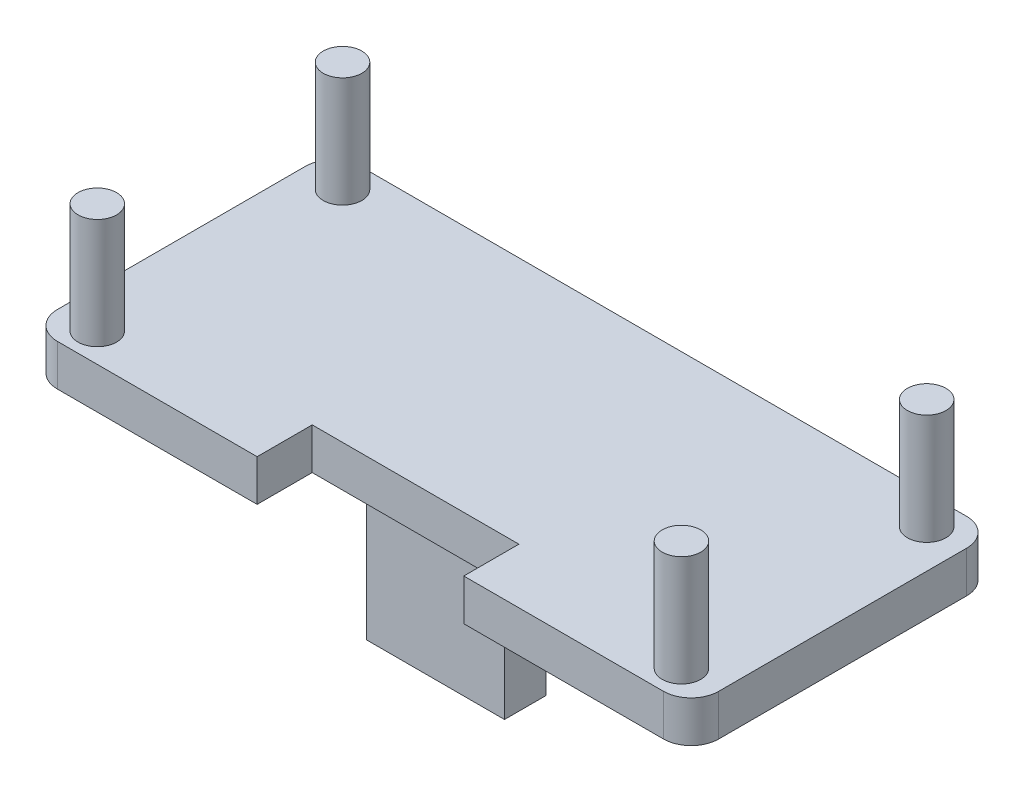
ISO-10303-21;
HEADER;
FILE_DESCRIPTION(('STEP AP214'),'2;1');
FILE_NAME('part.step','',(''),(''),'','','');
FILE_SCHEMA(('AUTOMOTIVE_DESIGN { 1 0 10303 214 1 1 1 1 }'));
ENDSEC;
DATA;
#1=APPLICATION_CONTEXT('core data for automotive mechanical design processes');
#2=APPLICATION_PROTOCOL_DEFINITION('international standard','automotive_design',2000,#1);
#3=PRODUCT_CONTEXT('',#1,'mechanical');
#4=PRODUCT('Part','Part','',(#3));
#5=PRODUCT_RELATED_PRODUCT_CATEGORY('part','',(#4));
#6=PRODUCT_DEFINITION_FORMATION('','',#4);
#7=PRODUCT_DEFINITION_CONTEXT('part definition',#1,'design');
#8=PRODUCT_DEFINITION('design','',#6,#7);
#9=PRODUCT_DEFINITION_SHAPE('','',#8);
#10=(LENGTH_UNIT() NAMED_UNIT(*) SI_UNIT(.MILLI.,.METRE.));
#11=(NAMED_UNIT(*) PLANE_ANGLE_UNIT() SI_UNIT($,.RADIAN.));
#12=(NAMED_UNIT(*) SI_UNIT($,.STERADIAN.) SOLID_ANGLE_UNIT());
#13=UNCERTAINTY_MEASURE_WITH_UNIT(LENGTH_MEASURE(1.E-05),#10,'distance_accuracy_value','');
#14=(GEOMETRIC_REPRESENTATION_CONTEXT(3) GLOBAL_UNCERTAINTY_ASSIGNED_CONTEXT((#13)) GLOBAL_UNIT_ASSIGNED_CONTEXT((#10,
#11,#12)) REPRESENTATION_CONTEXT('',''));
#15=CARTESIAN_POINT('',(0.,0.,0.));
#16=DIRECTION('',(0.,0.,1.));
#17=DIRECTION('',(1.,0.,0.));
#18=AXIS2_PLACEMENT_3D('',#15,#16,#17);
#19=CARTESIAN_POINT('',(-24.,3.,11.));
#20=DIRECTION('',(0.,0.,-1.));
#21=DIRECTION('',(-1.,0.,0.));
#22=AXIS2_PLACEMENT_3D('',#19,#20,#21);
#23=PLANE('',#22);
#24=DIRECTION('',(1.,0.,0.));
#25=VECTOR('',#24,1.);
#26=CARTESIAN_POINT('',(-24.,0.,11.));
#27=LINE('',#26,#25);
#28=CARTESIAN_POINT('',(7.5,0.,11.));
#29=VERTEX_POINT('',#28);
#30=CARTESIAN_POINT('',(22.,0.,11.));
#31=VERTEX_POINT('',#30);
#32=EDGE_CURVE('E166',#29,#31,#27,.T.);
#33=ORIENTED_EDGE('',*,*,#32,.T.);
#34=DIRECTION('',(0.,-1.,0.));
#35=VECTOR('',#34,1.);
#36=CARTESIAN_POINT('',(22.,3.,11.));
#37=LINE('',#36,#35);
#38=CARTESIAN_POINT('',(22.,3.,11.));
#39=VERTEX_POINT('',#38);
#40=EDGE_CURVE('E212',#31,#39,#37,.F.);
#41=ORIENTED_EDGE('',*,*,#40,.T.);
#42=DIRECTION('',(1.,0.,0.));
#43=VECTOR('',#42,1.);
#44=CARTESIAN_POINT('',(-24.,3.,11.));
#45=LINE('',#44,#43);
#46=CARTESIAN_POINT('',(7.5,3.,11.));
#47=VERTEX_POINT('',#46);
#48=EDGE_CURVE('E169',#47,#39,#45,.T.);
#49=ORIENTED_EDGE('',*,*,#48,.F.);
#50=DIRECTION('',(0.,-1.,0.));
#51=VECTOR('',#50,1.);
#52=CARTESIAN_POINT('',(7.5,10.,11.));
#53=LINE('',#52,#51);
#54=EDGE_CURVE('E153',#47,#29,#53,.T.);
#55=ORIENTED_EDGE('',*,*,#54,.T.);
#56=EDGE_LOOP('',(#33,#41,#49,#55));
#57=FACE_BOUND('',#56,.T.);
#58=ADVANCED_FACE('F37',(#57),#23,.F.);
#59=CARTESIAN_POINT('',(0.,0.,0.));
#60=DIRECTION('',(0.,-1.,0.));
#61=DIRECTION('',(0.,0.,-1.));
#62=AXIS2_PLACEMENT_3D('',#59,#60,#61);
#63=PLANE('',#62);
#64=DIRECTION('',(0.,0.,-1.));
#65=VECTOR('',#64,1.);
#66=CARTESIAN_POINT('',(24.,0.,11.));
#67=LINE('',#66,#65);
#68=CARTESIAN_POINT('',(24.,0.,9.));
#69=VERTEX_POINT('',#68);
#70=CARTESIAN_POINT('',(24.,0.,-9.));
#71=VERTEX_POINT('',#70);
#72=EDGE_CURVE('E241',#69,#71,#67,.T.);
#73=ORIENTED_EDGE('',*,*,#72,.F.);
#74=CARTESIAN_POINT('',(22.,0.,9.));
#75=DIRECTION('',(0.,-1.,0.));
#76=DIRECTION('',(0.,0.,-1.));
#77=AXIS2_PLACEMENT_3D('',#74,#75,#76);
#78=CIRCLE('',#77,2.);
#79=EDGE_CURVE('E176',#69,#31,#78,.T.);
#80=ORIENTED_EDGE('',*,*,#79,.T.);
#81=ORIENTED_EDGE('',*,*,#32,.F.);
#82=DIRECTION('',(0.,0.,1.));
#83=VECTOR('',#82,1.);
#84=CARTESIAN_POINT('',(7.5,0.,7.));
#85=LINE('',#84,#83);
#86=CARTESIAN_POINT('',(7.5,0.,7.));
#87=VERTEX_POINT('',#86);
#88=EDGE_CURVE('E150',#87,#29,#85,.T.);
#89=ORIENTED_EDGE('',*,*,#88,.F.);
#90=DIRECTION('',(1.,0.,0.));
#91=VECTOR('',#90,1.);
#92=CARTESIAN_POINT('',(-7.5,0.,7.));
#93=LINE('',#92,#91);
#94=CARTESIAN_POINT('',(-7.5,0.,7.));
#95=VERTEX_POINT('',#94);
#96=EDGE_CURVE('E171',#95,#87,#93,.T.);
#97=ORIENTED_EDGE('',*,*,#96,.F.);
#98=DIRECTION('',(0.,0.,-1.));
#99=VECTOR('',#98,1.);
#100=CARTESIAN_POINT('',(-7.5,0.,7.));
#101=LINE('',#100,#99);
#102=CARTESIAN_POINT('',(-7.5,0.,11.));
#103=VERTEX_POINT('',#102);
#104=EDGE_CURVE('E161',#103,#95,#101,.T.);
#105=ORIENTED_EDGE('',*,*,#104,.F.);
#106=CARTESIAN_POINT('',(-22.,0.,11.));
#107=VERTEX_POINT('',#106);
#108=EDGE_CURVE('E177',#107,#103,#27,.T.);
#109=ORIENTED_EDGE('',*,*,#108,.F.);
#110=CARTESIAN_POINT('',(-22.,0.,9.));
#111=DIRECTION('',(0.,-1.,0.));
#112=DIRECTION('',(0.,0.,-1.));
#113=AXIS2_PLACEMENT_3D('',#110,#111,#112);
#114=CIRCLE('',#113,2.);
#115=CARTESIAN_POINT('',(-24.,0.,9.));
#116=VERTEX_POINT('',#115);
#117=EDGE_CURVE('E209',#107,#116,#114,.T.);
#118=ORIENTED_EDGE('',*,*,#117,.T.);
#119=DIRECTION('',(0.,0.,1.));
#120=VECTOR('',#119,1.);
#121=CARTESIAN_POINT('',(-24.,0.,11.));
#122=LINE('',#121,#120);
#123=CARTESIAN_POINT('',(-24.,0.,-9.));
#124=VERTEX_POINT('',#123);
#125=EDGE_CURVE('E178',#124,#116,#122,.T.);
#126=ORIENTED_EDGE('',*,*,#125,.F.);
#127=CARTESIAN_POINT('',(-22.,0.,-9.));
#128=DIRECTION('',(0.,-1.,0.));
#129=DIRECTION('',(0.,0.,-1.));
#130=AXIS2_PLACEMENT_3D('',#127,#128,#129);
#131=CIRCLE('',#130,2.);
#132=CARTESIAN_POINT('',(-22.,0.,-11.));
#133=VERTEX_POINT('',#132);
#134=EDGE_CURVE('E207',#124,#133,#131,.T.);
#135=ORIENTED_EDGE('',*,*,#134,.T.);
#136=DIRECTION('',(-1.,0.,0.));
#137=VECTOR('',#136,1.);
#138=CARTESIAN_POINT('',(-24.,0.,-11.));
#139=LINE('',#138,#137);
#140=CARTESIAN_POINT('',(22.,0.,-11.));
#141=VERTEX_POINT('',#140);
#142=EDGE_CURVE('E181',#141,#133,#139,.T.);
#143=ORIENTED_EDGE('',*,*,#142,.F.);
#144=CARTESIAN_POINT('',(22.,0.,-9.));
#145=DIRECTION('',(0.,-1.,0.));
#146=DIRECTION('',(0.,0.,-1.));
#147=AXIS2_PLACEMENT_3D('',#144,#145,#146);
#148=CIRCLE('',#147,2.);
#149=EDGE_CURVE('E205',#141,#71,#148,.T.);
#150=ORIENTED_EDGE('',*,*,#149,.T.);
#151=EDGE_LOOP('',(#73,#80,#81,#89,#97,#105,#109,#118,#126,#135,#143,#150));
#152=FACE_BOUND('',#151,.T.);
#153=DIRECTION('',(-1.,0.,0.));
#154=VECTOR('',#153,1.);
#155=CARTESIAN_POINT('',(-4.99999999999999,0.,5.54476119451317));
#156=LINE('',#155,#154);
#157=CARTESIAN_POINT('',(5.00000000000001,0.,5.54476119451317));
#158=VERTEX_POINT('',#157);
#159=CARTESIAN_POINT('',(-4.99999999999999,0.,5.54476119451317));
#160=VERTEX_POINT('',#159);
#161=EDGE_CURVE('E285',#158,#160,#156,.T.);
#162=ORIENTED_EDGE('',*,*,#161,.F.);
#163=DIRECTION('',(0.,0.,1.));
#164=VECTOR('',#163,1.);
#165=CARTESIAN_POINT('',(5.00000000000001,0.,2.54476119451317));
#166=LINE('',#165,#164);
#167=CARTESIAN_POINT('',(5.00000000000001,0.,2.54476119451317));
#168=VERTEX_POINT('',#167);
#169=EDGE_CURVE('E287',#168,#158,#166,.T.);
#170=ORIENTED_EDGE('',*,*,#169,.F.);
#171=DIRECTION('',(1.,0.,0.));
#172=VECTOR('',#171,1.);
#173=CARTESIAN_POINT('',(-4.99999999999999,0.,2.54476119451317));
#174=LINE('',#173,#172);
#175=CARTESIAN_POINT('',(-4.99999999999999,0.,2.54476119451317));
#176=VERTEX_POINT('',#175);
#177=EDGE_CURVE('E279',#176,#168,#174,.T.);
#178=ORIENTED_EDGE('',*,*,#177,.F.);
#179=DIRECTION('',(0.,0.,-1.));
#180=VECTOR('',#179,1.);
#181=CARTESIAN_POINT('',(-4.99999999999999,0.,2.54476119451317));
#182=LINE('',#181,#180);
#183=EDGE_CURVE('E282',#160,#176,#182,.T.);
#184=ORIENTED_EDGE('',*,*,#183,.F.);
#185=EDGE_LOOP('',(#162,#170,#178,#184));
#186=FACE_BOUND('',#185,.T.);
#187=ADVANCED_FACE('F174',(#152,#186),#63,.T.);
#188=CARTESIAN_POINT('',(24.,3.,11.));
#189=DIRECTION('',(-1.,0.,0.));
#190=DIRECTION('',(0.,0.,1.));
#191=AXIS2_PLACEMENT_3D('',#188,#189,#190);
#192=PLANE('',#191);
#193=DIRECTION('',(0.,0.,-1.));
#194=VECTOR('',#193,1.);
#195=CARTESIAN_POINT('',(24.,3.,11.));
#196=LINE('',#195,#194);
#197=CARTESIAN_POINT('',(24.,3.,9.));
#198=VERTEX_POINT('',#197);
#199=CARTESIAN_POINT('',(24.,3.,-9.));
#200=VERTEX_POINT('',#199);
#201=EDGE_CURVE('E180',#198,#200,#196,.T.);
#202=ORIENTED_EDGE('',*,*,#201,.F.);
#203=DIRECTION('',(0.,-1.,0.));
#204=VECTOR('',#203,1.);
#205=CARTESIAN_POINT('',(24.,3.,9.));
#206=LINE('',#205,#204);
#207=EDGE_CURVE('E202',#198,#69,#206,.T.);
#208=ORIENTED_EDGE('',*,*,#207,.T.);
#209=ORIENTED_EDGE('',*,*,#72,.T.);
#210=DIRECTION('',(0.,-1.,0.));
#211=VECTOR('',#210,1.);
#212=CARTESIAN_POINT('',(24.,3.,-9.));
#213=LINE('',#212,#211);
#214=EDGE_CURVE('E200',#71,#200,#213,.F.);
#215=ORIENTED_EDGE('',*,*,#214,.T.);
#216=EDGE_LOOP('',(#202,#208,#209,#215));
#217=FACE_BOUND('',#216,.T.);
#218=ADVANCED_FACE('F337',(#217),#192,.F.);
#219=CARTESIAN_POINT('',(-24.,3.,-11.));
#220=DIRECTION('',(0.,0.,1.));
#221=DIRECTION('',(1.,0.,0.));
#222=AXIS2_PLACEMENT_3D('',#219,#220,#221);
#223=PLANE('',#222);
#224=ORIENTED_EDGE('',*,*,#142,.T.);
#225=DIRECTION('',(0.,-1.,0.));
#226=VECTOR('',#225,1.);
#227=CARTESIAN_POINT('',(-22.,3.,-11.));
#228=LINE('',#227,#226);
#229=CARTESIAN_POINT('',(-22.,3.,-11.));
#230=VERTEX_POINT('',#229);
#231=EDGE_CURVE('E11',#133,#230,#228,.F.);
#232=ORIENTED_EDGE('',*,*,#231,.T.);
#233=DIRECTION('',(-1.,0.,0.));
#234=VECTOR('',#233,1.);
#235=CARTESIAN_POINT('',(-24.,3.,-11.));
#236=LINE('',#235,#234);
#237=CARTESIAN_POINT('',(22.,3.,-11.));
#238=VERTEX_POINT('',#237);
#239=EDGE_CURVE('E236',#238,#230,#236,.T.);
#240=ORIENTED_EDGE('',*,*,#239,.F.);
#241=DIRECTION('',(0.,-1.,0.));
#242=VECTOR('',#241,1.);
#243=CARTESIAN_POINT('',(22.,3.,-11.));
#244=LINE('',#243,#242);
#245=EDGE_CURVE('E45',#238,#141,#244,.T.);
#246=ORIENTED_EDGE('',*,*,#245,.T.);
#247=EDGE_LOOP('',(#224,#232,#240,#246));
#248=FACE_BOUND('',#247,.T.);
#249=ADVANCED_FACE('F233',(#248),#223,.F.);
#250=CARTESIAN_POINT('',(-24.,3.,11.));
#251=DIRECTION('',(1.,0.,0.));
#252=DIRECTION('',(0.,0.,-1.));
#253=AXIS2_PLACEMENT_3D('',#250,#251,#252);
#254=PLANE('',#253);
#255=ORIENTED_EDGE('',*,*,#125,.T.);
#256=DIRECTION('',(0.,-1.,0.));
#257=VECTOR('',#256,1.);
#258=CARTESIAN_POINT('',(-24.,3.,9.));
#259=LINE('',#258,#257);
#260=CARTESIAN_POINT('',(-24.,3.,9.));
#261=VERTEX_POINT('',#260);
#262=EDGE_CURVE('E60',#116,#261,#259,.F.);
#263=ORIENTED_EDGE('',*,*,#262,.T.);
#264=DIRECTION('',(0.,0.,1.));
#265=VECTOR('',#264,1.);
#266=CARTESIAN_POINT('',(-24.,3.,11.));
#267=LINE('',#266,#265);
#268=CARTESIAN_POINT('',(-24.,3.,-9.));
#269=VERTEX_POINT('',#268);
#270=EDGE_CURVE('E246',#269,#261,#267,.T.);
#271=ORIENTED_EDGE('',*,*,#270,.F.);
#272=DIRECTION('',(0.,-1.,0.));
#273=VECTOR('',#272,1.);
#274=CARTESIAN_POINT('',(-24.,3.,-9.));
#275=LINE('',#274,#273);
#276=EDGE_CURVE('E224',#269,#124,#275,.T.);
#277=ORIENTED_EDGE('',*,*,#276,.T.);
#278=EDGE_LOOP('',(#255,#263,#271,#277));
#279=FACE_BOUND('',#278,.T.);
#280=ADVANCED_FACE('F318',(#279),#254,.F.);
#281=CARTESIAN_POINT('',(-22.,3.,11.));
#282=VERTEX_POINT('',#281);
#283=CARTESIAN_POINT('',(-7.5,3.,11.));
#284=VERTEX_POINT('',#283);
#285=EDGE_CURVE('E189',#282,#284,#45,.T.);
#286=ORIENTED_EDGE('',*,*,#285,.F.);
#287=DIRECTION('',(0.,-1.,0.));
#288=VECTOR('',#287,1.);
#289=CARTESIAN_POINT('',(-22.,3.,11.));
#290=LINE('',#289,#288);
#291=EDGE_CURVE('E221',#282,#107,#290,.T.);
#292=ORIENTED_EDGE('',*,*,#291,.T.);
#293=ORIENTED_EDGE('',*,*,#108,.T.);
#294=DIRECTION('',(0.,-1.,0.));
#295=VECTOR('',#294,1.);
#296=CARTESIAN_POINT('',(-7.5,10.,11.));
#297=LINE('',#296,#295);
#298=EDGE_CURVE('E170',#284,#103,#297,.T.);
#299=ORIENTED_EDGE('',*,*,#298,.F.);
#300=EDGE_LOOP('',(#286,#292,#293,#299));
#301=FACE_BOUND('',#300,.T.);
#302=ADVANCED_FACE('F315',(#301),#23,.F.);
#303=CARTESIAN_POINT('',(0.,3.,0.));
#304=DIRECTION('',(0.,-1.,0.));
#305=DIRECTION('',(0.,0.,-1.));
#306=AXIS2_PLACEMENT_3D('',#303,#304,#305);
#307=PLANE('',#306);
#308=CARTESIAN_POINT('',(21.2000000000001,3.,8.89999997399999));
#309=DIRECTION('',(0.,1.,0.));
#310=DIRECTION('',(0.,0.,1.));
#311=AXIS2_PLACEMENT_3D('',#308,#309,#310);
#312=CIRCLE('',#311,1.39999999999971);
#313=CARTESIAN_POINT('',(21.2000000000001,3.,10.2999999739997));
#314=VERTEX_POINT('',#313);
#315=EDGE_CURVE('E263',#314,#314,#312,.F.);
#316=ORIENTED_EDGE('',*,*,#315,.T.);
#317=EDGE_LOOP('',(#316));
#318=FACE_BOUND('',#317,.T.);
#319=CARTESIAN_POINT('',(21.2000000000001,3.,-8.899999974));
#320=DIRECTION('',(0.,-1.,0.));
#321=DIRECTION('',(0.,0.,-1.));
#322=AXIS2_PLACEMENT_3D('',#319,#320,#321);
#323=CIRCLE('',#322,1.39999999999988);
#324=CARTESIAN_POINT('',(21.2000000000001,3.,-10.2999999739999));
#325=VERTEX_POINT('',#324);
#326=EDGE_CURVE('E188',#325,#325,#323,.F.);
#327=ORIENTED_EDGE('',*,*,#326,.F.);
#328=EDGE_LOOP('',(#327));
#329=FACE_BOUND('',#328,.T.);
#330=CARTESIAN_POINT('',(-21.2000000000001,3.,8.899999974));
#331=DIRECTION('',(0.,-1.,0.));
#332=DIRECTION('',(0.,0.,-1.));
#333=AXIS2_PLACEMENT_3D('',#330,#331,#332);
#334=CIRCLE('',#333,1.4);
#335=CARTESIAN_POINT('',(-21.2000000000001,3.,7.499999974));
#336=VERTEX_POINT('',#335);
#337=EDGE_CURVE('E185',#336,#336,#334,.F.);
#338=ORIENTED_EDGE('',*,*,#337,.F.);
#339=EDGE_LOOP('',(#338));
#340=FACE_BOUND('',#339,.T.);
#341=CARTESIAN_POINT('',(-21.2000000000001,3.,-8.899999974));
#342=DIRECTION('',(0.,1.,0.));
#343=DIRECTION('',(0.,0.,1.));
#344=AXIS2_PLACEMENT_3D('',#341,#342,#343);
#345=CIRCLE('',#344,1.4);
#346=CARTESIAN_POINT('',(-21.2000000000001,3.,-7.499999974));
#347=VERTEX_POINT('',#346);
#348=EDGE_CURVE('E251',#347,#347,#345,.F.);
#349=ORIENTED_EDGE('',*,*,#348,.T.);
#350=EDGE_LOOP('',(#349));
#351=FACE_BOUND('',#350,.T.);
#352=ORIENTED_EDGE('',*,*,#48,.T.);
#353=CARTESIAN_POINT('',(22.,3.,9.));
#354=DIRECTION('',(0.,-1.,0.));
#355=DIRECTION('',(0.,0.,-1.));
#356=AXIS2_PLACEMENT_3D('',#353,#354,#355);
#357=CIRCLE('',#356,2.);
#358=EDGE_CURVE('E219',#39,#198,#357,.F.);
#359=ORIENTED_EDGE('',*,*,#358,.T.);
#360=ORIENTED_EDGE('',*,*,#201,.T.);
#361=CARTESIAN_POINT('',(22.,3.,-9.));
#362=DIRECTION('',(0.,-1.,0.));
#363=DIRECTION('',(0.,0.,-1.));
#364=AXIS2_PLACEMENT_3D('',#361,#362,#363);
#365=CIRCLE('',#364,2.);
#366=EDGE_CURVE('E214',#200,#238,#365,.F.);
#367=ORIENTED_EDGE('',*,*,#366,.T.);
#368=ORIENTED_EDGE('',*,*,#239,.T.);
#369=CARTESIAN_POINT('',(-22.,3.,-9.));
#370=DIRECTION('',(0.,-1.,0.));
#371=DIRECTION('',(0.,0.,-1.));
#372=AXIS2_PLACEMENT_3D('',#369,#370,#371);
#373=CIRCLE('',#372,2.);
#374=EDGE_CURVE('E216',#230,#269,#373,.F.);
#375=ORIENTED_EDGE('',*,*,#374,.T.);
#376=ORIENTED_EDGE('',*,*,#270,.T.);
#377=CARTESIAN_POINT('',(-22.,3.,9.));
#378=DIRECTION('',(0.,-1.,0.));
#379=DIRECTION('',(0.,0.,-1.));
#380=AXIS2_PLACEMENT_3D('',#377,#378,#379);
#381=CIRCLE('',#380,2.);
#382=EDGE_CURVE('E52',#261,#282,#381,.F.);
#383=ORIENTED_EDGE('',*,*,#382,.T.);
#384=ORIENTED_EDGE('',*,*,#285,.T.);
#385=DIRECTION('',(0.,0.,-1.));
#386=VECTOR('',#385,1.);
#387=CARTESIAN_POINT('',(-7.5,3.,0.));
#388=LINE('',#387,#386);
#389=CARTESIAN_POINT('',(-7.5,3.,7.));
#390=VERTEX_POINT('',#389);
#391=EDGE_CURVE('E192',#284,#390,#388,.T.);
#392=ORIENTED_EDGE('',*,*,#391,.T.);
#393=DIRECTION('',(1.,0.,0.));
#394=VECTOR('',#393,1.);
#395=CARTESIAN_POINT('',(0.,3.,7.));
#396=LINE('',#395,#394);
#397=CARTESIAN_POINT('',(7.5,3.,7.));
#398=VERTEX_POINT('',#397);
#399=EDGE_CURVE('E195',#390,#398,#396,.T.);
#400=ORIENTED_EDGE('',*,*,#399,.T.);
#401=DIRECTION('',(0.,0.,1.));
#402=VECTOR('',#401,1.);
#403=CARTESIAN_POINT('',(7.5,3.,0.));
#404=LINE('',#403,#402);
#405=EDGE_CURVE('E198',#398,#47,#404,.T.);
#406=ORIENTED_EDGE('',*,*,#405,.T.);
#407=EDGE_LOOP('',(#352,#359,#360,#367,#368,#375,#376,#383,#384,#392,#400,#406));
#408=FACE_BOUND('',#407,.T.);
#409=ADVANCED_FACE('F313',(#318,#329,#340,#351,#408),#307,.F.);
#410=CARTESIAN_POINT('',(-21.2000000000001,11.,-8.899999974));
#411=DIRECTION('',(0.,-1.,0.));
#412=DIRECTION('',(0.,0.,-1.));
#413=AXIS2_PLACEMENT_3D('',#410,#411,#412);
#414=CYLINDRICAL_SURFACE('',#413,1.4);
#415=CARTESIAN_POINT('',(-21.2000000000001,11.,-8.899999974));
#416=DIRECTION('',(0.,1.,0.));
#417=DIRECTION('',(0.,0.,1.));
#418=AXIS2_PLACEMENT_3D('',#415,#416,#417);
#419=CIRCLE('',#418,1.4);
#420=CARTESIAN_POINT('',(-21.2000000000001,11.,-7.499999974));
#421=VERTEX_POINT('',#420);
#422=EDGE_CURVE('E242',#421,#421,#419,.F.);
#423=ORIENTED_EDGE('',*,*,#422,.T.);
#424=EDGE_LOOP('',(#423));
#425=FACE_BOUND('',#424,.T.);
#426=ORIENTED_EDGE('',*,*,#348,.F.);
#427=EDGE_LOOP('',(#426));
#428=FACE_BOUND('',#427,.T.);
#429=ADVANCED_FACE('F345',(#425,#428),#414,.T.);
#430=CARTESIAN_POINT('',(0.,11.,0.));
#431=DIRECTION('',(0.,1.,0.));
#432=DIRECTION('',(0.,0.,1.));
#433=AXIS2_PLACEMENT_3D('',#430,#431,#432);
#434=PLANE('',#433);
#435=ORIENTED_EDGE('',*,*,#422,.F.);
#436=EDGE_LOOP('',(#435));
#437=FACE_BOUND('',#436,.T.);
#438=ADVANCED_FACE('F548',(#437),#434,.T.);
#439=CARTESIAN_POINT('',(-21.2000000000001,11.,8.899999974));
#440=DIRECTION('',(0.,-1.,0.));
#441=DIRECTION('',(0.,0.,-1.));
#442=AXIS2_PLACEMENT_3D('',#439,#440,#441);
#443=CYLINDRICAL_SURFACE('',#442,1.4);
#444=CARTESIAN_POINT('',(-21.2000000000001,11.,8.899999974));
#445=DIRECTION('',(0.,1.,0.));
#446=DIRECTION('',(0.,0.,1.));
#447=AXIS2_PLACEMENT_3D('',#444,#445,#446);
#448=CIRCLE('',#447,1.4);
#449=CARTESIAN_POINT('',(-21.2000000000001,11.,10.299999974));
#450=VERTEX_POINT('',#449);
#451=EDGE_CURVE('E254',#450,#450,#448,.T.);
#452=ORIENTED_EDGE('',*,*,#451,.F.);
#453=EDGE_LOOP('',(#452));
#454=FACE_BOUND('',#453,.T.);
#455=ORIENTED_EDGE('',*,*,#337,.T.);
#456=EDGE_LOOP('',(#455));
#457=FACE_BOUND('',#456,.T.);
#458=ADVANCED_FACE('F538',(#454,#457),#443,.T.);
#459=CARTESIAN_POINT('',(0.,11.,0.));
#460=DIRECTION('',(0.,1.,0.));
#461=DIRECTION('',(0.,0.,1.));
#462=AXIS2_PLACEMENT_3D('',#459,#460,#461);
#463=PLANE('',#462);
#464=ORIENTED_EDGE('',*,*,#451,.T.);
#465=EDGE_LOOP('',(#464));
#466=FACE_BOUND('',#465,.T.);
#467=ADVANCED_FACE('F528',(#466),#463,.T.);
#468=CARTESIAN_POINT('',(21.2000000000001,11.,-8.899999974));
#469=DIRECTION('',(0.,-1.,0.));
#470=DIRECTION('',(0.,0.,-1.));
#471=AXIS2_PLACEMENT_3D('',#468,#469,#470);
#472=CYLINDRICAL_SURFACE('',#471,1.39999999999988);
#473=CARTESIAN_POINT('',(21.2000000000001,11.,-8.899999974));
#474=DIRECTION('',(0.,1.,0.));
#475=DIRECTION('',(0.,0.,1.));
#476=AXIS2_PLACEMENT_3D('',#473,#474,#475);
#477=CIRCLE('',#476,1.39999999999988);
#478=CARTESIAN_POINT('',(21.2000000000001,11.,-7.49999997400013));
#479=VERTEX_POINT('',#478);
#480=EDGE_CURVE('E259',#479,#479,#477,.T.);
#481=ORIENTED_EDGE('',*,*,#480,.F.);
#482=EDGE_LOOP('',(#481));
#483=FACE_BOUND('',#482,.T.);
#484=ORIENTED_EDGE('',*,*,#326,.T.);
#485=EDGE_LOOP('',(#484));
#486=FACE_BOUND('',#485,.T.);
#487=ADVANCED_FACE('F518',(#483,#486),#472,.T.);
#488=CARTESIAN_POINT('',(0.,11.,0.));
#489=DIRECTION('',(0.,1.,0.));
#490=DIRECTION('',(0.,0.,1.));
#491=AXIS2_PLACEMENT_3D('',#488,#489,#490);
#492=PLANE('',#491);
#493=ORIENTED_EDGE('',*,*,#480,.T.);
#494=EDGE_LOOP('',(#493));
#495=FACE_BOUND('',#494,.T.);
#496=ADVANCED_FACE('F508',(#495),#492,.T.);
#497=CARTESIAN_POINT('',(21.2000000000001,11.,8.89999997399999));
#498=DIRECTION('',(0.,-1.,0.));
#499=DIRECTION('',(0.,0.,-1.));
#500=AXIS2_PLACEMENT_3D('',#497,#498,#499);
#501=CYLINDRICAL_SURFACE('',#500,1.39999999999971);
#502=CARTESIAN_POINT('',(21.2000000000001,11.,8.89999997399999));
#503=DIRECTION('',(0.,1.,0.));
#504=DIRECTION('',(0.,0.,1.));
#505=AXIS2_PLACEMENT_3D('',#502,#503,#504);
#506=CIRCLE('',#505,1.39999999999971);
#507=CARTESIAN_POINT('',(21.2000000000001,11.,10.2999999739997));
#508=VERTEX_POINT('',#507);
#509=EDGE_CURVE('E262',#508,#508,#506,.F.);
#510=ORIENTED_EDGE('',*,*,#509,.T.);
#511=EDGE_LOOP('',(#510));
#512=FACE_BOUND('',#511,.T.);
#513=ORIENTED_EDGE('',*,*,#315,.F.);
#514=EDGE_LOOP('',(#513));
#515=FACE_BOUND('',#514,.T.);
#516=ADVANCED_FACE('F498',(#512,#515),#501,.T.);
#517=CARTESIAN_POINT('',(0.,11.,0.));
#518=DIRECTION('',(0.,1.,0.));
#519=DIRECTION('',(0.,0.,1.));
#520=AXIS2_PLACEMENT_3D('',#517,#518,#519);
#521=PLANE('',#520);
#522=ORIENTED_EDGE('',*,*,#509,.F.);
#523=EDGE_LOOP('',(#522));
#524=FACE_BOUND('',#523,.T.);
#525=ADVANCED_FACE('F489',(#524),#521,.T.);
#526=CARTESIAN_POINT('',(5.00000000000001,-10.,2.54476119451317));
#527=DIRECTION('',(-1.,0.,0.));
#528=DIRECTION('',(0.,0.,1.));
#529=AXIS2_PLACEMENT_3D('',#526,#527,#528);
#530=PLANE('',#529);
#531=ORIENTED_EDGE('',*,*,#169,.T.);
#532=DIRECTION('',(0.,1.,0.));
#533=VECTOR('',#532,1.);
#534=CARTESIAN_POINT('',(5.00000000000001,-10.,5.54476119451317));
#535=LINE('',#534,#533);
#536=CARTESIAN_POINT('',(5.00000000000001,-10.,5.54476119451317));
#537=VERTEX_POINT('',#536);
#538=EDGE_CURVE('E266',#537,#158,#535,.T.);
#539=ORIENTED_EDGE('',*,*,#538,.F.);
#540=DIRECTION('',(0.,0.,1.));
#541=VECTOR('',#540,1.);
#542=CARTESIAN_POINT('',(5.00000000000001,-10.,2.54476119451317));
#543=LINE('',#542,#541);
#544=CARTESIAN_POINT('',(5.00000000000001,-10.,2.54476119451317));
#545=VERTEX_POINT('',#544);
#546=EDGE_CURVE('E281',#545,#537,#543,.T.);
#547=ORIENTED_EDGE('',*,*,#546,.F.);
#548=DIRECTION('',(0.,1.,0.));
#549=VECTOR('',#548,1.);
#550=CARTESIAN_POINT('',(5.00000000000001,-10.,2.54476119451317));
#551=LINE('',#550,#549);
#552=EDGE_CURVE('E275',#545,#168,#551,.T.);
#553=ORIENTED_EDGE('',*,*,#552,.T.);
#554=EDGE_LOOP('',(#531,#539,#547,#553));
#555=FACE_BOUND('',#554,.T.);
#556=ADVANCED_FACE('F480',(#555),#530,.F.);
#557=CARTESIAN_POINT('',(-4.99999999999999,-10.,5.54476119451317));
#558=DIRECTION('',(0.,0.,-1.));
#559=DIRECTION('',(-1.,0.,0.));
#560=AXIS2_PLACEMENT_3D('',#557,#558,#559);
#561=PLANE('',#560);
#562=ORIENTED_EDGE('',*,*,#161,.T.);
#563=DIRECTION('',(0.,1.,0.));
#564=VECTOR('',#563,1.);
#565=CARTESIAN_POINT('',(-4.99999999999999,-10.,5.54476119451317));
#566=LINE('',#565,#564);
#567=CARTESIAN_POINT('',(-4.99999999999999,-10.,5.54476119451317));
#568=VERTEX_POINT('',#567);
#569=EDGE_CURVE('E270',#568,#160,#566,.T.);
#570=ORIENTED_EDGE('',*,*,#569,.F.);
#571=DIRECTION('',(-1.,0.,0.));
#572=VECTOR('',#571,1.);
#573=CARTESIAN_POINT('',(-4.99999999999999,-10.,5.54476119451317));
#574=LINE('',#573,#572);
#575=EDGE_CURVE('E293',#537,#568,#574,.T.);
#576=ORIENTED_EDGE('',*,*,#575,.F.);
#577=ORIENTED_EDGE('',*,*,#538,.T.);
#578=EDGE_LOOP('',(#562,#570,#576,#577));
#579=FACE_BOUND('',#578,.T.);
#580=ADVANCED_FACE('F470',(#579),#561,.F.);
#581=CARTESIAN_POINT('',(-4.99999999999999,-10.,2.54476119451317));
#582=DIRECTION('',(1.,0.,0.));
#583=DIRECTION('',(0.,0.,-1.));
#584=AXIS2_PLACEMENT_3D('',#581,#582,#583);
#585=PLANE('',#584);
#586=ORIENTED_EDGE('',*,*,#183,.T.);
#587=DIRECTION('',(0.,1.,0.));
#588=VECTOR('',#587,1.);
#589=CARTESIAN_POINT('',(-4.99999999999999,-10.,2.54476119451317));
#590=LINE('',#589,#588);
#591=CARTESIAN_POINT('',(-4.99999999999999,-10.,2.54476119451317));
#592=VERTEX_POINT('',#591);
#593=EDGE_CURVE('E273',#592,#176,#590,.T.);
#594=ORIENTED_EDGE('',*,*,#593,.F.);
#595=DIRECTION('',(0.,0.,-1.));
#596=VECTOR('',#595,1.);
#597=CARTESIAN_POINT('',(-4.99999999999999,-10.,2.54476119451317));
#598=LINE('',#597,#596);
#599=EDGE_CURVE('E291',#568,#592,#598,.T.);
#600=ORIENTED_EDGE('',*,*,#599,.F.);
#601=ORIENTED_EDGE('',*,*,#569,.T.);
#602=EDGE_LOOP('',(#586,#594,#600,#601));
#603=FACE_BOUND('',#602,.T.);
#604=ADVANCED_FACE('F460',(#603),#585,.F.);
#605=CARTESIAN_POINT('',(-4.99999999999999,-10.,2.54476119451317));
#606=DIRECTION('',(0.,0.,1.));
#607=DIRECTION('',(1.,0.,0.));
#608=AXIS2_PLACEMENT_3D('',#605,#606,#607);
#609=PLANE('',#608);
#610=ORIENTED_EDGE('',*,*,#177,.T.);
#611=ORIENTED_EDGE('',*,*,#552,.F.);
#612=DIRECTION('',(1.,0.,0.));
#613=VECTOR('',#612,1.);
#614=CARTESIAN_POINT('',(-4.99999999999999,-10.,2.54476119451317));
#615=LINE('',#614,#613);
#616=EDGE_CURVE('E278',#592,#545,#615,.T.);
#617=ORIENTED_EDGE('',*,*,#616,.F.);
#618=ORIENTED_EDGE('',*,*,#593,.T.);
#619=EDGE_LOOP('',(#610,#611,#617,#618));
#620=FACE_BOUND('',#619,.T.);
#621=ADVANCED_FACE('F450',(#620),#609,.F.);
#622=CARTESIAN_POINT('',(0.,-10.,0.));
#623=DIRECTION('',(0.,1.,0.));
#624=DIRECTION('',(0.,0.,1.));
#625=AXIS2_PLACEMENT_3D('',#622,#623,#624);
#626=PLANE('',#625);
#627=ORIENTED_EDGE('',*,*,#546,.T.);
#628=ORIENTED_EDGE('',*,*,#575,.T.);
#629=ORIENTED_EDGE('',*,*,#599,.T.);
#630=ORIENTED_EDGE('',*,*,#616,.T.);
#631=EDGE_LOOP('',(#627,#628,#629,#630));
#632=FACE_BOUND('',#631,.T.);
#633=ADVANCED_FACE('F442',(#632),#626,.F.);
#634=CARTESIAN_POINT('',(7.5,10.,7.));
#635=DIRECTION('',(1.,0.,0.));
#636=DIRECTION('',(0.,0.,-1.));
#637=AXIS2_PLACEMENT_3D('',#634,#635,#636);
#638=PLANE('',#637);
#639=DIRECTION('',(0.,-1.,0.));
#640=VECTOR('',#639,1.);
#641=CARTESIAN_POINT('',(7.5,10.,7.));
#642=LINE('',#641,#640);
#643=EDGE_CURVE('E156',#398,#87,#642,.T.);
#644=ORIENTED_EDGE('',*,*,#643,.T.);
#645=ORIENTED_EDGE('',*,*,#88,.T.);
#646=ORIENTED_EDGE('',*,*,#54,.F.);
#647=ORIENTED_EDGE('',*,*,#405,.F.);
#648=EDGE_LOOP('',(#644,#645,#646,#647));
#649=FACE_BOUND('',#648,.T.);
#650=ADVANCED_FACE('F152',(#649),#638,.F.);
#651=CARTESIAN_POINT('',(-7.5,10.,7.));
#652=DIRECTION('',(0.,0.,-1.));
#653=DIRECTION('',(-1.,0.,0.));
#654=AXIS2_PLACEMENT_3D('',#651,#652,#653);
#655=PLANE('',#654);
#656=DIRECTION('',(0.,-1.,0.));
#657=VECTOR('',#656,1.);
#658=CARTESIAN_POINT('',(-7.5,10.,7.));
#659=LINE('',#658,#657);
#660=EDGE_CURVE('E299',#390,#95,#659,.T.);
#661=ORIENTED_EDGE('',*,*,#660,.T.);
#662=ORIENTED_EDGE('',*,*,#96,.T.);
#663=ORIENTED_EDGE('',*,*,#643,.F.);
#664=ORIENTED_EDGE('',*,*,#399,.F.);
#665=EDGE_LOOP('',(#661,#662,#663,#664));
#666=FACE_BOUND('',#665,.T.);
#667=ADVANCED_FACE('F312',(#666),#655,.F.);
#668=CARTESIAN_POINT('',(-7.5,10.,7.));
#669=DIRECTION('',(-1.,0.,0.));
#670=DIRECTION('',(0.,0.,1.));
#671=AXIS2_PLACEMENT_3D('',#668,#669,#670);
#672=PLANE('',#671);
#673=ORIENTED_EDGE('',*,*,#298,.T.);
#674=ORIENTED_EDGE('',*,*,#104,.T.);
#675=ORIENTED_EDGE('',*,*,#660,.F.);
#676=ORIENTED_EDGE('',*,*,#391,.F.);
#677=EDGE_LOOP('',(#673,#674,#675,#676));
#678=FACE_BOUND('',#677,.T.);
#679=ADVANCED_FACE('F306',(#678),#672,.F.);
#680=CARTESIAN_POINT('',(22.,3.,9.));
#681=DIRECTION('',(0.,-1.,0.));
#682=DIRECTION('',(0.,0.,-1.));
#683=AXIS2_PLACEMENT_3D('',#680,#681,#682);
#684=CYLINDRICAL_SURFACE('',#683,2.);
#685=ORIENTED_EDGE('',*,*,#358,.F.);
#686=ORIENTED_EDGE('',*,*,#40,.F.);
#687=ORIENTED_EDGE('',*,*,#79,.F.);
#688=ORIENTED_EDGE('',*,*,#207,.F.);
#689=EDGE_LOOP('',(#685,#686,#687,#688));
#690=FACE_BOUND('',#689,.T.);
#691=ADVANCED_FACE('F323',(#690),#684,.T.);
#692=CARTESIAN_POINT('',(-22.,3.,9.));
#693=DIRECTION('',(0.,-1.,0.));
#694=DIRECTION('',(0.,0.,-1.));
#695=AXIS2_PLACEMENT_3D('',#692,#693,#694);
#696=CYLINDRICAL_SURFACE('',#695,2.);
#697=ORIENTED_EDGE('',*,*,#382,.F.);
#698=ORIENTED_EDGE('',*,*,#262,.F.);
#699=ORIENTED_EDGE('',*,*,#117,.F.);
#700=ORIENTED_EDGE('',*,*,#291,.F.);
#701=EDGE_LOOP('',(#697,#698,#699,#700));
#702=FACE_BOUND('',#701,.T.);
#703=ADVANCED_FACE('F320',(#702),#696,.T.);
#704=CARTESIAN_POINT('',(-22.,3.,-9.));
#705=DIRECTION('',(0.,-1.,0.));
#706=DIRECTION('',(0.,0.,-1.));
#707=AXIS2_PLACEMENT_3D('',#704,#705,#706);
#708=CYLINDRICAL_SURFACE('',#707,2.);
#709=ORIENTED_EDGE('',*,*,#374,.F.);
#710=ORIENTED_EDGE('',*,*,#231,.F.);
#711=ORIENTED_EDGE('',*,*,#134,.F.);
#712=ORIENTED_EDGE('',*,*,#276,.F.);
#713=EDGE_LOOP('',(#709,#710,#711,#712));
#714=FACE_BOUND('',#713,.T.);
#715=ADVANCED_FACE('F322',(#714),#708,.T.);
#716=CARTESIAN_POINT('',(22.,3.,-9.));
#717=DIRECTION('',(0.,-1.,0.));
#718=DIRECTION('',(0.,0.,-1.));
#719=AXIS2_PLACEMENT_3D('',#716,#717,#718);
#720=CYLINDRICAL_SURFACE('',#719,2.);
#721=ORIENTED_EDGE('',*,*,#366,.F.);
#722=ORIENTED_EDGE('',*,*,#214,.F.);
#723=ORIENTED_EDGE('',*,*,#149,.F.);
#724=ORIENTED_EDGE('',*,*,#245,.F.);
#725=EDGE_LOOP('',(#721,#722,#723,#724));
#726=FACE_BOUND('',#725,.T.);
#727=ADVANCED_FACE('F39',(#726),#720,.T.);
#728=CLOSED_SHELL('',(#58,#187,#218,#249,#280,#302,#409,#429,#438,#458,#467,#487,#496,#516,#525,
#556,#580,#604,#621,#633,#650,#667,#679,#691,#703,#715,#727));
#729=MANIFOLD_SOLID_BREP('B2',#728);
#730=ADVANCED_BREP_SHAPE_REPRESENTATION('',(#18,#729),#14);
#731=SHAPE_DEFINITION_REPRESENTATION(#9,#730);
ENDSEC;
END-ISO-10303-21;
